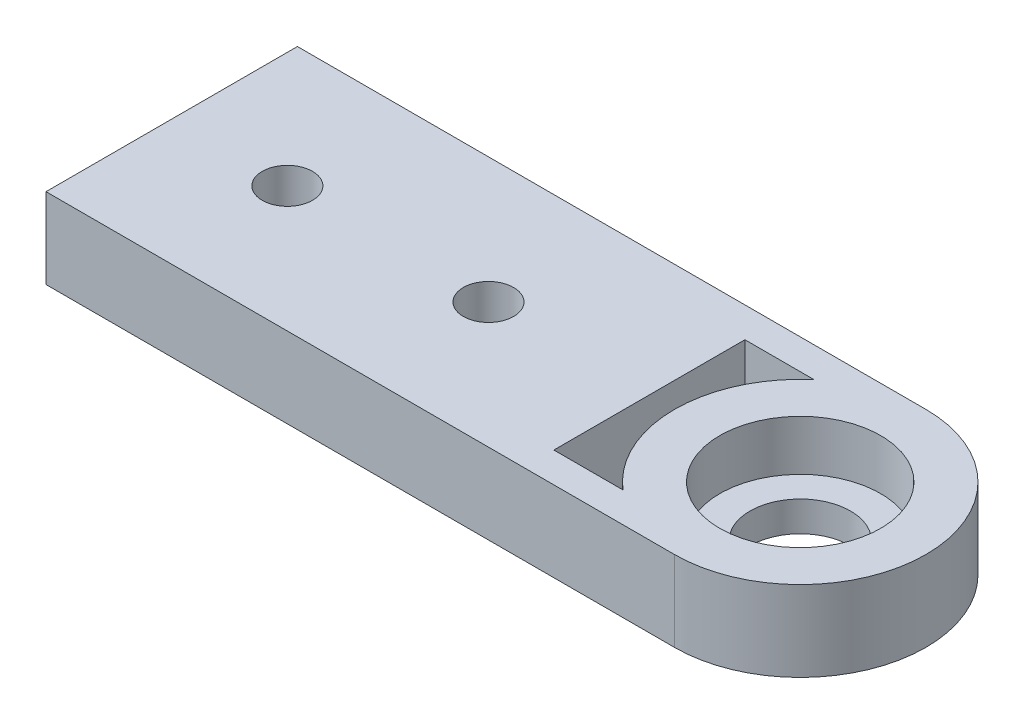
ISO-10303-21;
HEADER;
FILE_DESCRIPTION(('STEP AP214'),'2;1');
FILE_NAME('part.step','',(''),(''),'','','');
FILE_SCHEMA(('AUTOMOTIVE_DESIGN { 1 0 10303 214 1 1 1 1 }'));
ENDSEC;
DATA;
#1=APPLICATION_CONTEXT('core data for automotive mechanical design processes');
#2=APPLICATION_PROTOCOL_DEFINITION('international standard','automotive_design',2000,#1);
#3=PRODUCT_CONTEXT('',#1,'mechanical');
#4=PRODUCT('Part','Part','',(#3));
#5=PRODUCT_RELATED_PRODUCT_CATEGORY('part','',(#4));
#6=PRODUCT_DEFINITION_FORMATION('','',#4);
#7=PRODUCT_DEFINITION_CONTEXT('part definition',#1,'design');
#8=PRODUCT_DEFINITION('design','',#6,#7);
#9=PRODUCT_DEFINITION_SHAPE('','',#8);
#10=(LENGTH_UNIT() NAMED_UNIT(*) SI_UNIT(.MILLI.,.METRE.));
#11=(NAMED_UNIT(*) PLANE_ANGLE_UNIT() SI_UNIT($,.RADIAN.));
#12=(NAMED_UNIT(*) SI_UNIT($,.STERADIAN.) SOLID_ANGLE_UNIT());
#13=UNCERTAINTY_MEASURE_WITH_UNIT(LENGTH_MEASURE(1.E-05),#10,'distance_accuracy_value','');
#14=(GEOMETRIC_REPRESENTATION_CONTEXT(3) GLOBAL_UNCERTAINTY_ASSIGNED_CONTEXT((#13)) GLOBAL_UNIT_ASSIGNED_CONTEXT((#10,
#11,#12)) REPRESENTATION_CONTEXT('',''));
#15=CARTESIAN_POINT('',(0.,0.,0.));
#16=DIRECTION('',(0.,0.,1.));
#17=DIRECTION('',(1.,0.,0.));
#18=AXIS2_PLACEMENT_3D('',#15,#16,#17);
#19=CARTESIAN_POINT('',(31.25,8.,0.));
#20=DIRECTION('',(0.,-1.,0.));
#21=DIRECTION('',(0.,0.,-1.));
#22=AXIS2_PLACEMENT_3D('',#19,#20,#21);
#23=CYLINDRICAL_SURFACE('',#22,5.);
#24=CARTESIAN_POINT('',(31.25,0.,0.));
#25=DIRECTION('',(0.,1.,0.));
#26=DIRECTION('',(0.,0.,1.));
#27=AXIS2_PLACEMENT_3D('',#24,#25,#26);
#28=CIRCLE('',#27,5.);
#29=CARTESIAN_POINT('',(31.25,0.,5.));
#30=VERTEX_POINT('',#29);
#31=EDGE_CURVE('E157',#30,#30,#28,.T.);
#32=ORIENTED_EDGE('',*,*,#31,.F.);
#33=EDGE_LOOP('',(#32));
#34=FACE_BOUND('',#33,.T.);
#35=CARTESIAN_POINT('',(31.25,3.,0.));
#36=DIRECTION('',(0.,1.,0.));
#37=DIRECTION('',(0.,0.,1.));
#38=AXIS2_PLACEMENT_3D('',#35,#36,#37);
#39=CIRCLE('',#38,5.);
#40=CARTESIAN_POINT('',(31.25,3.,5.));
#41=VERTEX_POINT('',#40);
#42=EDGE_CURVE('E43',#41,#41,#39,.T.);
#43=ORIENTED_EDGE('',*,*,#42,.T.);
#44=EDGE_LOOP('',(#43));
#45=FACE_BOUND('',#44,.T.);
#46=ADVANCED_FACE('F39',(#34,#45),#23,.F.);
#47=CARTESIAN_POINT('',(31.25,8.,0.));
#48=DIRECTION('',(0.,1.,0.));
#49=DIRECTION('',(0.,0.,1.));
#50=AXIS2_PLACEMENT_3D('',#47,#48,#49);
#51=PLANE('',#50);
#52=CARTESIAN_POINT('',(0.249999999998151,8.,0.));
#53=DIRECTION('',(0.,1.,0.));
#54=DIRECTION('',(0.,0.,1.));
#55=AXIS2_PLACEMENT_3D('',#52,#53,#54);
#56=CIRCLE('',#55,2.5);
#57=CARTESIAN_POINT('',(0.249999999998151,8.,2.5));
#58=VERTEX_POINT('',#57);
#59=EDGE_CURVE('E137',#58,#58,#56,.T.);
#60=ORIENTED_EDGE('',*,*,#59,.F.);
#61=EDGE_LOOP('',(#60));
#62=FACE_BOUND('',#61,.T.);
#63=CARTESIAN_POINT('',(-19.7500000000007,8.,0.));
#64=DIRECTION('',(0.,1.,0.));
#65=DIRECTION('',(0.,0.,1.));
#66=AXIS2_PLACEMENT_3D('',#63,#64,#65);
#67=CIRCLE('',#66,2.5);
#68=CARTESIAN_POINT('',(-19.7500000000007,8.,2.49999999999999));
#69=VERTEX_POINT('',#68);
#70=EDGE_CURVE('E141',#69,#69,#67,.T.);
#71=ORIENTED_EDGE('',*,*,#70,.F.);
#72=EDGE_LOOP('',(#71));
#73=FACE_BOUND('',#72,.T.);
#74=CARTESIAN_POINT('',(31.25,8.,0.));
#75=DIRECTION('',(0.,1.,0.));
#76=DIRECTION('',(0.,0.,1.));
#77=AXIS2_PLACEMENT_3D('',#74,#75,#76);
#78=CIRCLE('',#77,8.);
#79=CARTESIAN_POINT('',(31.25,8.,8.));
#80=VERTEX_POINT('',#79);
#81=EDGE_CURVE('E149',#80,#80,#78,.T.);
#82=ORIENTED_EDGE('',*,*,#81,.F.);
#83=EDGE_LOOP('',(#82));
#84=FACE_BOUND('',#83,.T.);
#85=DIRECTION('',(-1.,0.,0.));
#86=VECTOR('',#85,1.);
#87=CARTESIAN_POINT('',(23.125961595364,8.,-9.5));
#88=LINE('',#87,#86);
#89=CARTESIAN_POINT('',(23.125961595364,8.,-9.5));
#90=VERTEX_POINT('',#89);
#91=CARTESIAN_POINT('',(16.25,8.,-9.5));
#92=VERTEX_POINT('',#91);
#93=EDGE_CURVE('E164',#90,#92,#88,.T.);
#94=ORIENTED_EDGE('',*,*,#93,.F.);
#95=CARTESIAN_POINT('',(31.25,8.,0.));
#96=DIRECTION('',(0.,-1.,0.));
#97=DIRECTION('',(0.,0.,1.));
#98=AXIS2_PLACEMENT_3D('',#95,#96,#97);
#99=CIRCLE('',#98,12.5);
#100=CARTESIAN_POINT('',(23.125961595364,8.,9.50000000000001));
#101=VERTEX_POINT('',#100);
#102=EDGE_CURVE('E161',#101,#90,#99,.T.);
#103=ORIENTED_EDGE('',*,*,#102,.F.);
#104=DIRECTION('',(1.,0.,0.));
#105=VECTOR('',#104,1.);
#106=CARTESIAN_POINT('',(23.125961595364,8.,9.50000000000001));
#107=LINE('',#106,#105);
#108=CARTESIAN_POINT('',(16.25,8.,9.50000000000001));
#109=VERTEX_POINT('',#108);
#110=EDGE_CURVE('E171',#109,#101,#107,.T.);
#111=ORIENTED_EDGE('',*,*,#110,.F.);
#112=DIRECTION('',(0.,0.,1.));
#113=VECTOR('',#112,1.);
#114=CARTESIAN_POINT('',(16.25,8.,-9.5));
#115=LINE('',#114,#113);
#116=EDGE_CURVE('E168',#92,#109,#115,.T.);
#117=ORIENTED_EDGE('',*,*,#116,.F.);
#118=EDGE_LOOP('',(#94,#103,#111,#117));
#119=FACE_BOUND('',#118,.T.);
#120=DIRECTION('',(1.,0.,0.));
#121=VECTOR('',#120,1.);
#122=CARTESIAN_POINT('',(16.25,8.,12.5));
#123=LINE('',#122,#121);
#124=CARTESIAN_POINT('',(-31.25,8.,12.5));
#125=VERTEX_POINT('',#124);
#126=CARTESIAN_POINT('',(31.25,8.,12.5));
#127=VERTEX_POINT('',#126);
#128=EDGE_CURVE('E198',#125,#127,#123,.T.);
#129=ORIENTED_EDGE('',*,*,#128,.T.);
#130=CARTESIAN_POINT('',(31.25,8.,0.));
#131=DIRECTION('',(0.,1.,0.));
#132=DIRECTION('',(0.,0.,1.));
#133=AXIS2_PLACEMENT_3D('',#130,#131,#132);
#134=CIRCLE('',#133,12.5);
#135=CARTESIAN_POINT('',(31.25,8.,-12.5));
#136=VERTEX_POINT('',#135);
#137=EDGE_CURVE('E202',#127,#136,#134,.T.);
#138=ORIENTED_EDGE('',*,*,#137,.T.);
#139=DIRECTION('',(-1.,0.,0.));
#140=VECTOR('',#139,1.);
#141=CARTESIAN_POINT('',(16.25,8.,-12.5));
#142=LINE('',#141,#140);
#143=CARTESIAN_POINT('',(-31.25,8.,-12.5));
#144=VERTEX_POINT('',#143);
#145=EDGE_CURVE('E205',#136,#144,#142,.T.);
#146=ORIENTED_EDGE('',*,*,#145,.T.);
#147=DIRECTION('',(0.,0.,-1.));
#148=VECTOR('',#147,1.);
#149=CARTESIAN_POINT('',(-31.25,8.,-12.5));
#150=LINE('',#149,#148);
#151=EDGE_CURVE('E135',#125,#144,#150,.T.);
#152=ORIENTED_EDGE('',*,*,#151,.F.);
#153=EDGE_LOOP('',(#129,#138,#146,#152));
#154=FACE_BOUND('',#153,.T.);
#155=ADVANCED_FACE('F231',(#62,#73,#84,#119,#154),#51,.T.);
#156=CARTESIAN_POINT('',(31.25,0.,0.));
#157=DIRECTION('',(0.,1.,0.));
#158=DIRECTION('',(0.,0.,1.));
#159=AXIS2_PLACEMENT_3D('',#156,#157,#158);
#160=PLANE('',#159);
#161=CARTESIAN_POINT('',(0.249999999998151,0.,0.));
#162=DIRECTION('',(0.,-1.,0.));
#163=DIRECTION('',(0.,0.,-1.));
#164=AXIS2_PLACEMENT_3D('',#161,#162,#163);
#165=CIRCLE('',#164,2.5);
#166=CARTESIAN_POINT('',(0.249999999998151,0.,-2.5));
#167=VERTEX_POINT('',#166);
#168=EDGE_CURVE('E390',#167,#167,#165,.T.);
#169=ORIENTED_EDGE('',*,*,#168,.F.);
#170=EDGE_LOOP('',(#169));
#171=FACE_BOUND('',#170,.T.);
#172=CARTESIAN_POINT('',(-19.7500000000007,0.,0.));
#173=DIRECTION('',(0.,-1.,0.));
#174=DIRECTION('',(0.,0.,-1.));
#175=AXIS2_PLACEMENT_3D('',#172,#173,#174);
#176=CIRCLE('',#175,2.5);
#177=CARTESIAN_POINT('',(-19.7500000000007,0.,-2.50000000000001));
#178=VERTEX_POINT('',#177);
#179=EDGE_CURVE('E392',#178,#178,#176,.T.);
#180=ORIENTED_EDGE('',*,*,#179,.F.);
#181=EDGE_LOOP('',(#180));
#182=FACE_BOUND('',#181,.T.);
#183=CARTESIAN_POINT('',(31.25,0.,0.));
#184=DIRECTION('',(0.,1.,0.));
#185=DIRECTION('',(0.,0.,1.));
#186=AXIS2_PLACEMENT_3D('',#183,#184,#185);
#187=CIRCLE('',#186,12.5);
#188=CARTESIAN_POINT('',(31.25,0.,12.5));
#189=VERTEX_POINT('',#188);
#190=CARTESIAN_POINT('',(31.25,0.,-12.5));
#191=VERTEX_POINT('',#190);
#192=EDGE_CURVE('E120',#189,#191,#187,.T.);
#193=ORIENTED_EDGE('',*,*,#192,.F.);
#194=DIRECTION('',(1.,0.,0.));
#195=VECTOR('',#194,1.);
#196=CARTESIAN_POINT('',(-16.25,0.,12.5));
#197=LINE('',#196,#195);
#198=CARTESIAN_POINT('',(-31.25,0.,12.5));
#199=VERTEX_POINT('',#198);
#200=EDGE_CURVE('E119',#199,#189,#197,.T.);
#201=ORIENTED_EDGE('',*,*,#200,.F.);
#202=DIRECTION('',(0.,0.,1.));
#203=VECTOR('',#202,1.);
#204=CARTESIAN_POINT('',(-31.25,0.,-12.5));
#205=LINE('',#204,#203);
#206=CARTESIAN_POINT('',(-31.25,0.,-12.5));
#207=VERTEX_POINT('',#206);
#208=EDGE_CURVE('E123',#207,#199,#205,.T.);
#209=ORIENTED_EDGE('',*,*,#208,.F.);
#210=DIRECTION('',(-1.,0.,0.));
#211=VECTOR('',#210,1.);
#212=CARTESIAN_POINT('',(-16.25,0.,-12.5));
#213=LINE('',#212,#211);
#214=EDGE_CURVE('E108',#191,#207,#213,.T.);
#215=ORIENTED_EDGE('',*,*,#214,.F.);
#216=EDGE_LOOP('',(#193,#201,#209,#215));
#217=FACE_BOUND('',#216,.T.);
#218=CARTESIAN_POINT('',(31.25,0.,0.));
#219=DIRECTION('',(0.,-1.,0.));
#220=DIRECTION('',(0.,0.,1.));
#221=AXIS2_PLACEMENT_3D('',#218,#219,#220);
#222=CIRCLE('',#221,12.5);
#223=CARTESIAN_POINT('',(23.125961595364,0.,9.50000000000001));
#224=VERTEX_POINT('',#223);
#225=CARTESIAN_POINT('',(23.125961595364,0.,-9.5));
#226=VERTEX_POINT('',#225);
#227=EDGE_CURVE('E64',#224,#226,#222,.T.);
#228=ORIENTED_EDGE('',*,*,#227,.T.);
#229=DIRECTION('',(-1.,0.,0.));
#230=VECTOR('',#229,1.);
#231=CARTESIAN_POINT('',(23.125961595364,0.,-9.5));
#232=LINE('',#231,#230);
#233=CARTESIAN_POINT('',(16.25,0.,-9.5));
#234=VERTEX_POINT('',#233);
#235=EDGE_CURVE('E177',#226,#234,#232,.T.);
#236=ORIENTED_EDGE('',*,*,#235,.T.);
#237=DIRECTION('',(0.,0.,1.));
#238=VECTOR('',#237,1.);
#239=CARTESIAN_POINT('',(16.25,0.,-9.5));
#240=LINE('',#239,#238);
#241=CARTESIAN_POINT('',(16.25,0.,9.50000000000001));
#242=VERTEX_POINT('',#241);
#243=EDGE_CURVE('E181',#234,#242,#240,.T.);
#244=ORIENTED_EDGE('',*,*,#243,.T.);
#245=DIRECTION('',(1.,0.,0.));
#246=VECTOR('',#245,1.);
#247=CARTESIAN_POINT('',(23.125961595364,0.,9.50000000000001));
#248=LINE('',#247,#246);
#249=EDGE_CURVE('E165',#242,#224,#248,.T.);
#250=ORIENTED_EDGE('',*,*,#249,.T.);
#251=EDGE_LOOP('',(#228,#236,#244,#250));
#252=FACE_BOUND('',#251,.T.);
#253=ORIENTED_EDGE('',*,*,#31,.T.);
#254=EDGE_LOOP('',(#253));
#255=FACE_BOUND('',#254,.T.);
#256=ADVANCED_FACE('F124',(#171,#182,#217,#252,#255),#160,.F.);
#257=CARTESIAN_POINT('',(31.25,8.,0.));
#258=DIRECTION('',(0.,-1.,0.));
#259=DIRECTION('',(0.,0.,-1.));
#260=AXIS2_PLACEMENT_3D('',#257,#258,#259);
#261=CYLINDRICAL_SURFACE('',#260,12.5);
#262=ORIENTED_EDGE('',*,*,#192,.T.);
#263=DIRECTION('',(0.,-1.,0.));
#264=VECTOR('',#263,1.);
#265=CARTESIAN_POINT('',(31.25,8.,-12.5));
#266=LINE('',#265,#264);
#267=EDGE_CURVE('E49',#136,#191,#266,.T.);
#268=ORIENTED_EDGE('',*,*,#267,.F.);
#269=ORIENTED_EDGE('',*,*,#137,.F.);
#270=DIRECTION('',(0.,-1.,0.));
#271=VECTOR('',#270,1.);
#272=CARTESIAN_POINT('',(31.25,8.,12.5));
#273=LINE('',#272,#271);
#274=EDGE_CURVE('E11',#127,#189,#273,.T.);
#275=ORIENTED_EDGE('',*,*,#274,.T.);
#276=EDGE_LOOP('',(#262,#268,#269,#275));
#277=FACE_BOUND('',#276,.T.);
#278=ADVANCED_FACE('F41',(#277),#261,.T.);
#279=CARTESIAN_POINT('',(-16.25,8.,-12.5));
#280=DIRECTION('',(0.,0.,1.));
#281=DIRECTION('',(1.,0.,0.));
#282=AXIS2_PLACEMENT_3D('',#279,#280,#281);
#283=PLANE('',#282);
#284=ORIENTED_EDGE('',*,*,#214,.T.);
#285=DIRECTION('',(0.,-1.,0.));
#286=VECTOR('',#285,1.);
#287=CARTESIAN_POINT('',(-31.25,0.,-12.5));
#288=LINE('',#287,#286);
#289=EDGE_CURVE('E113',#144,#207,#288,.T.);
#290=ORIENTED_EDGE('',*,*,#289,.F.);
#291=ORIENTED_EDGE('',*,*,#145,.F.);
#292=ORIENTED_EDGE('',*,*,#267,.T.);
#293=EDGE_LOOP('',(#284,#290,#291,#292));
#294=FACE_BOUND('',#293,.T.);
#295=ADVANCED_FACE('F110',(#294),#283,.F.);
#296=CARTESIAN_POINT('',(-16.25,8.,12.5));
#297=DIRECTION('',(0.,0.,-1.));
#298=DIRECTION('',(-1.,0.,0.));
#299=AXIS2_PLACEMENT_3D('',#296,#297,#298);
#300=PLANE('',#299);
#301=ORIENTED_EDGE('',*,*,#200,.T.);
#302=ORIENTED_EDGE('',*,*,#274,.F.);
#303=ORIENTED_EDGE('',*,*,#128,.F.);
#304=DIRECTION('',(0.,1.,0.));
#305=VECTOR('',#304,1.);
#306=CARTESIAN_POINT('',(-31.25,0.,12.5));
#307=LINE('',#306,#305);
#308=EDGE_CURVE('E130',#199,#125,#307,.T.);
#309=ORIENTED_EDGE('',*,*,#308,.F.);
#310=EDGE_LOOP('',(#301,#302,#303,#309));
#311=FACE_BOUND('',#310,.T.);
#312=ADVANCED_FACE('F242',(#311),#300,.F.);
#313=CARTESIAN_POINT('',(31.25,8.,0.));
#314=DIRECTION('',(0.,-1.,0.));
#315=DIRECTION('',(0.,0.,-1.));
#316=AXIS2_PLACEMENT_3D('',#313,#314,#315);
#317=CYLINDRICAL_SURFACE('',#316,12.5);
#318=ORIENTED_EDGE('',*,*,#227,.F.);
#319=DIRECTION('',(0.,-1.,0.));
#320=VECTOR('',#319,1.);
#321=CARTESIAN_POINT('',(23.125961595364,8.,9.50000000000001));
#322=LINE('',#321,#320);
#323=EDGE_CURVE('E174',#101,#224,#322,.T.);
#324=ORIENTED_EDGE('',*,*,#323,.F.);
#325=ORIENTED_EDGE('',*,*,#102,.T.);
#326=DIRECTION('',(0.,-1.,0.));
#327=VECTOR('',#326,1.);
#328=CARTESIAN_POINT('',(23.125961595364,8.,-9.5));
#329=LINE('',#328,#327);
#330=EDGE_CURVE('E195',#90,#226,#329,.T.);
#331=ORIENTED_EDGE('',*,*,#330,.T.);
#332=EDGE_LOOP('',(#318,#324,#325,#331));
#333=FACE_BOUND('',#332,.T.);
#334=ADVANCED_FACE('F268',(#333),#317,.T.);
#335=CARTESIAN_POINT('',(23.125961595364,8.,-9.5));
#336=DIRECTION('',(0.,0.,1.));
#337=DIRECTION('',(1.,0.,0.));
#338=AXIS2_PLACEMENT_3D('',#335,#336,#337);
#339=PLANE('',#338);
#340=ORIENTED_EDGE('',*,*,#235,.F.);
#341=ORIENTED_EDGE('',*,*,#330,.F.);
#342=ORIENTED_EDGE('',*,*,#93,.T.);
#343=DIRECTION('',(0.,-1.,0.));
#344=VECTOR('',#343,1.);
#345=CARTESIAN_POINT('',(16.25,8.,-9.5));
#346=LINE('',#345,#344);
#347=EDGE_CURVE('E192',#92,#234,#346,.T.);
#348=ORIENTED_EDGE('',*,*,#347,.T.);
#349=EDGE_LOOP('',(#340,#341,#342,#348));
#350=FACE_BOUND('',#349,.T.);
#351=ADVANCED_FACE('F264',(#350),#339,.T.);
#352=CARTESIAN_POINT('',(16.25,8.,-9.5));
#353=DIRECTION('',(1.,0.,0.));
#354=DIRECTION('',(0.,0.,-1.));
#355=AXIS2_PLACEMENT_3D('',#352,#353,#354);
#356=PLANE('',#355);
#357=ORIENTED_EDGE('',*,*,#243,.F.);
#358=ORIENTED_EDGE('',*,*,#347,.F.);
#359=ORIENTED_EDGE('',*,*,#116,.T.);
#360=DIRECTION('',(0.,-1.,0.));
#361=VECTOR('',#360,1.);
#362=CARTESIAN_POINT('',(16.25,8.,9.50000000000001));
#363=LINE('',#362,#361);
#364=EDGE_CURVE('E56',#109,#242,#363,.T.);
#365=ORIENTED_EDGE('',*,*,#364,.T.);
#366=EDGE_LOOP('',(#357,#358,#359,#365));
#367=FACE_BOUND('',#366,.T.);
#368=ADVANCED_FACE('F261',(#367),#356,.T.);
#369=CARTESIAN_POINT('',(23.125961595364,8.,9.50000000000001));
#370=DIRECTION('',(0.,0.,-1.));
#371=DIRECTION('',(-1.,0.,0.));
#372=AXIS2_PLACEMENT_3D('',#369,#370,#371);
#373=PLANE('',#372);
#374=ORIENTED_EDGE('',*,*,#249,.F.);
#375=ORIENTED_EDGE('',*,*,#364,.F.);
#376=ORIENTED_EDGE('',*,*,#110,.T.);
#377=ORIENTED_EDGE('',*,*,#323,.T.);
#378=EDGE_LOOP('',(#374,#375,#376,#377));
#379=FACE_BOUND('',#378,.T.);
#380=ADVANCED_FACE('F227',(#379),#373,.T.);
#381=CARTESIAN_POINT('',(31.25,3.,0.));
#382=DIRECTION('',(0.,1.,0.));
#383=DIRECTION('',(0.,0.,1.));
#384=AXIS2_PLACEMENT_3D('',#381,#382,#383);
#385=CYLINDRICAL_SURFACE('',#384,8.);
#386=CARTESIAN_POINT('',(31.25,3.,0.));
#387=DIRECTION('',(0.,1.,0.));
#388=DIRECTION('',(0.,0.,1.));
#389=AXIS2_PLACEMENT_3D('',#386,#387,#388);
#390=CIRCLE('',#389,8.);
#391=CARTESIAN_POINT('',(31.25,3.,8.));
#392=VERTEX_POINT('',#391);
#393=EDGE_CURVE('E150',#392,#392,#390,.T.);
#394=ORIENTED_EDGE('',*,*,#393,.F.);
#395=EDGE_LOOP('',(#394));
#396=FACE_BOUND('',#395,.T.);
#397=ORIENTED_EDGE('',*,*,#81,.T.);
#398=EDGE_LOOP('',(#397));
#399=FACE_BOUND('',#398,.T.);
#400=ADVANCED_FACE('F221',(#396,#399),#385,.F.);
#401=CARTESIAN_POINT('',(31.25,3.,0.));
#402=DIRECTION('',(0.,1.,0.));
#403=DIRECTION('',(0.,0.,1.));
#404=AXIS2_PLACEMENT_3D('',#401,#402,#403);
#405=PLANE('',#404);
#406=ORIENTED_EDGE('',*,*,#42,.F.);
#407=EDGE_LOOP('',(#406));
#408=FACE_BOUND('',#407,.T.);
#409=ORIENTED_EDGE('',*,*,#393,.T.);
#410=EDGE_LOOP('',(#409));
#411=FACE_BOUND('',#410,.T.);
#412=ADVANCED_FACE('F218',(#408,#411),#405,.T.);
#413=CARTESIAN_POINT('',(-31.25,0.,0.));
#414=DIRECTION('',(1.,0.,0.));
#415=DIRECTION('',(0.,0.,-1.));
#416=AXIS2_PLACEMENT_3D('',#413,#414,#415);
#417=PLANE('',#416);
#418=ORIENTED_EDGE('',*,*,#289,.T.);
#419=ORIENTED_EDGE('',*,*,#208,.T.);
#420=ORIENTED_EDGE('',*,*,#308,.T.);
#421=ORIENTED_EDGE('',*,*,#151,.T.);
#422=EDGE_LOOP('',(#418,#419,#420,#421));
#423=FACE_BOUND('',#422,.T.);
#424=ADVANCED_FACE('F133',(#423),#417,.F.);
#425=CARTESIAN_POINT('',(-19.7500000000007,10.,0.));
#426=DIRECTION('',(0.,-1.,0.));
#427=DIRECTION('',(0.,0.,-1.));
#428=AXIS2_PLACEMENT_3D('',#425,#426,#427);
#429=CYLINDRICAL_SURFACE('',#428,2.5);
#430=ORIENTED_EDGE('',*,*,#70,.T.);
#431=EDGE_LOOP('',(#430));
#432=FACE_BOUND('',#431,.T.);
#433=ORIENTED_EDGE('',*,*,#179,.T.);
#434=EDGE_LOOP('',(#433));
#435=FACE_BOUND('',#434,.T.);
#436=ADVANCED_FACE('F282',(#432,#435),#429,.F.);
#437=CARTESIAN_POINT('',(0.249999999998151,10.,0.));
#438=DIRECTION('',(0.,-1.,0.));
#439=DIRECTION('',(0.,0.,-1.));
#440=AXIS2_PLACEMENT_3D('',#437,#438,#439);
#441=CYLINDRICAL_SURFACE('',#440,2.5);
#442=ORIENTED_EDGE('',*,*,#59,.T.);
#443=EDGE_LOOP('',(#442));
#444=FACE_BOUND('',#443,.T.);
#445=ORIENTED_EDGE('',*,*,#168,.T.);
#446=EDGE_LOOP('',(#445));
#447=FACE_BOUND('',#446,.T.);
#448=ADVANCED_FACE('F290',(#444,#447),#441,.F.);
#449=CLOSED_SHELL('',(#46,#155,#256,#278,#295,#312,#334,#351,#368,#380,#400,#412,#424,#436,#448));
#450=MANIFOLD_SOLID_BREP('B2',#449);
#451=ADVANCED_BREP_SHAPE_REPRESENTATION('',(#18,#450),#14);
#452=SHAPE_DEFINITION_REPRESENTATION(#9,#451);
ENDSEC;
END-ISO-10303-21;
